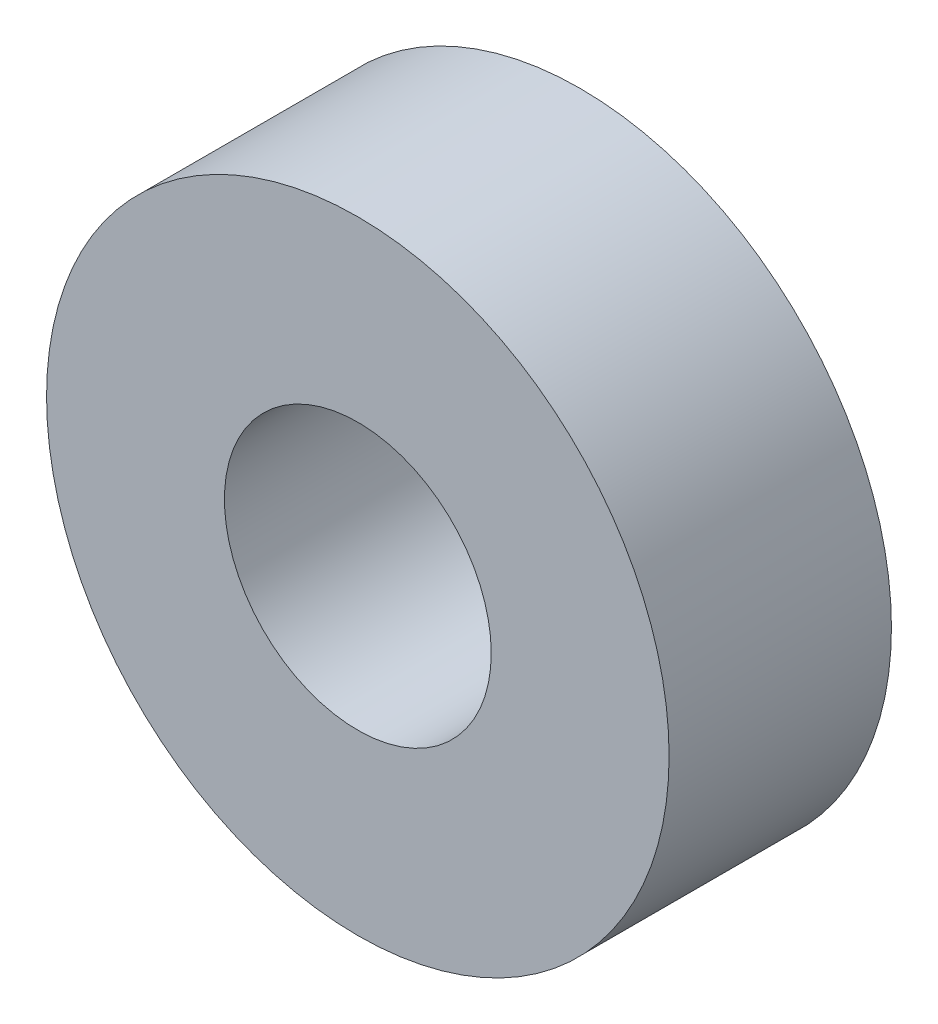
ISO-10303-21;
HEADER;
FILE_DESCRIPTION(('STEP AP214'),'2;1');
FILE_NAME('part.step','',(''),(''),'','','');
FILE_SCHEMA(('AUTOMOTIVE_DESIGN { 1 0 10303 214 1 1 1 1 }'));
ENDSEC;
DATA;
#1=APPLICATION_CONTEXT('core data for automotive mechanical design processes');
#2=APPLICATION_PROTOCOL_DEFINITION('international standard','automotive_design',2000,#1);
#3=PRODUCT_CONTEXT('',#1,'mechanical');
#4=PRODUCT('Part','Part','',(#3));
#5=PRODUCT_RELATED_PRODUCT_CATEGORY('part','',(#4));
#6=PRODUCT_DEFINITION_FORMATION('','',#4);
#7=PRODUCT_DEFINITION_CONTEXT('part definition',#1,'design');
#8=PRODUCT_DEFINITION('design','',#6,#7);
#9=PRODUCT_DEFINITION_SHAPE('','',#8);
#10=(LENGTH_UNIT() NAMED_UNIT(*) SI_UNIT(.MILLI.,.METRE.));
#11=(NAMED_UNIT(*) PLANE_ANGLE_UNIT() SI_UNIT($,.RADIAN.));
#12=(NAMED_UNIT(*) SI_UNIT($,.STERADIAN.) SOLID_ANGLE_UNIT());
#13=UNCERTAINTY_MEASURE_WITH_UNIT(LENGTH_MEASURE(1.E-05),#10,'distance_accuracy_value','');
#14=(GEOMETRIC_REPRESENTATION_CONTEXT(3) GLOBAL_UNCERTAINTY_ASSIGNED_CONTEXT((#13)) GLOBAL_UNIT_ASSIGNED_CONTEXT((#10,
#11,#12)) REPRESENTATION_CONTEXT('',''));
#15=CARTESIAN_POINT('',(0.,0.,0.));
#16=DIRECTION('',(0.,0.,1.));
#17=DIRECTION('',(1.,0.,0.));
#18=AXIS2_PLACEMENT_3D('',#15,#16,#17);
#19=CARTESIAN_POINT('',(0.,0.,2.5));
#20=DIRECTION('',(0.,0.,1.));
#21=DIRECTION('',(1.,0.,0.));
#22=AXIS2_PLACEMENT_3D('',#19,#20,#21);
#23=PLANE('',#22);
#24=CARTESIAN_POINT('',(0.,0.,2.5));
#25=DIRECTION('',(0.,0.,1.));
#26=DIRECTION('',(1.,0.,0.));
#27=AXIS2_PLACEMENT_3D('',#24,#25,#26);
#28=CIRCLE('',#27,7.);
#29=CARTESIAN_POINT('',(7.,0.,2.5));
#30=VERTEX_POINT('',#29);
#31=EDGE_CURVE('E10',#30,#30,#28,.T.);
#32=ORIENTED_EDGE('',*,*,#31,.T.);
#33=EDGE_LOOP('',(#32));
#34=FACE_BOUND('',#33,.T.);
#35=CARTESIAN_POINT('',(0.,0.,2.5));
#36=DIRECTION('',(0.,0.,1.));
#37=DIRECTION('',(1.,0.,0.));
#38=AXIS2_PLACEMENT_3D('',#35,#36,#37);
#39=CIRCLE('',#38,3.);
#40=CARTESIAN_POINT('',(3.,0.,2.5));
#41=VERTEX_POINT('',#40);
#42=EDGE_CURVE('E42',#41,#41,#39,.T.);
#43=ORIENTED_EDGE('',*,*,#42,.F.);
#44=EDGE_LOOP('',(#43));
#45=FACE_BOUND('',#44,.T.);
#46=ADVANCED_FACE('F31',(#34,#45),#23,.T.);
#47=CARTESIAN_POINT('',(0.,0.,-2.5));
#48=DIRECTION('',(0.,0.,1.));
#49=DIRECTION('',(1.,0.,0.));
#50=AXIS2_PLACEMENT_3D('',#47,#48,#49);
#51=PLANE('',#50);
#52=CARTESIAN_POINT('',(0.,0.,-2.5));
#53=DIRECTION('',(0.,0.,1.));
#54=DIRECTION('',(1.,0.,0.));
#55=AXIS2_PLACEMENT_3D('',#52,#53,#54);
#56=CIRCLE('',#55,7.);
#57=CARTESIAN_POINT('',(7.,0.,-2.5));
#58=VERTEX_POINT('',#57);
#59=EDGE_CURVE('E35',#58,#58,#56,.T.);
#60=ORIENTED_EDGE('',*,*,#59,.F.);
#61=EDGE_LOOP('',(#60));
#62=FACE_BOUND('',#61,.T.);
#63=CARTESIAN_POINT('',(0.,0.,-2.5));
#64=DIRECTION('',(0.,0.,1.));
#65=DIRECTION('',(1.,0.,0.));
#66=AXIS2_PLACEMENT_3D('',#63,#64,#65);
#67=CIRCLE('',#66,3.);
#68=CARTESIAN_POINT('',(3.,0.,-2.5));
#69=VERTEX_POINT('',#68);
#70=EDGE_CURVE('E44',#69,#69,#67,.T.);
#71=ORIENTED_EDGE('',*,*,#70,.T.);
#72=EDGE_LOOP('',(#71));
#73=FACE_BOUND('',#72,.T.);
#74=ADVANCED_FACE('F54',(#62,#73),#51,.F.);
#75=CARTESIAN_POINT('',(0.,0.,2.5));
#76=DIRECTION('',(0.,0.,-1.));
#77=DIRECTION('',(-1.,0.,0.));
#78=AXIS2_PLACEMENT_3D('',#75,#76,#77);
#79=CYLINDRICAL_SURFACE('',#78,7.);
#80=ORIENTED_EDGE('',*,*,#31,.F.);
#81=EDGE_LOOP('',(#80));
#82=FACE_BOUND('',#81,.T.);
#83=ORIENTED_EDGE('',*,*,#59,.T.);
#84=EDGE_LOOP('',(#83));
#85=FACE_BOUND('',#84,.T.);
#86=ADVANCED_FACE('F33',(#82,#85),#79,.T.);
#87=CARTESIAN_POINT('',(0.,0.,2.5));
#88=DIRECTION('',(0.,0.,-1.));
#89=DIRECTION('',(-1.,0.,0.));
#90=AXIS2_PLACEMENT_3D('',#87,#88,#89);
#91=CYLINDRICAL_SURFACE('',#90,3.);
#92=ORIENTED_EDGE('',*,*,#42,.T.);
#93=EDGE_LOOP('',(#92));
#94=FACE_BOUND('',#93,.T.);
#95=ORIENTED_EDGE('',*,*,#70,.F.);
#96=EDGE_LOOP('',(#95));
#97=FACE_BOUND('',#96,.T.);
#98=ADVANCED_FACE('F50',(#94,#97),#91,.F.);
#99=CLOSED_SHELL('',(#46,#74,#86,#98));
#100=MANIFOLD_SOLID_BREP('B2',#99);
#101=ADVANCED_BREP_SHAPE_REPRESENTATION('',(#18,#100),#14);
#102=SHAPE_DEFINITION_REPRESENTATION(#9,#101);
ENDSEC;
END-ISO-10303-21;
